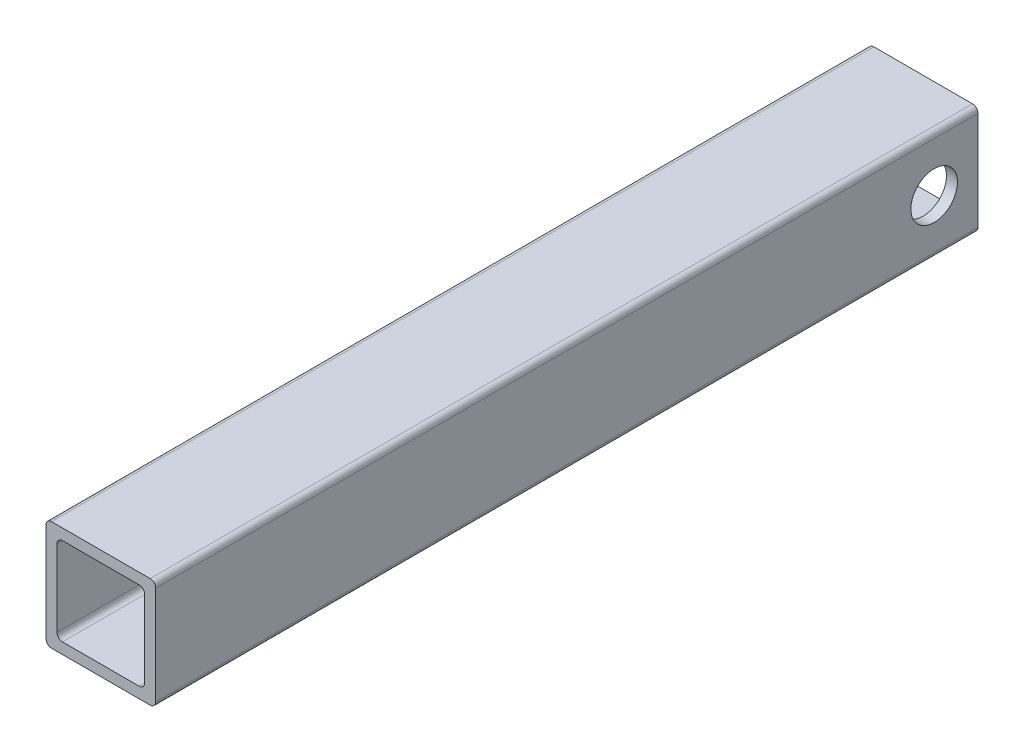
ISO-10303-21;
HEADER;
FILE_DESCRIPTION(('STEP AP214'),'2;1');
FILE_NAME('part.step','',(''),(''),'','','');
FILE_SCHEMA(('AUTOMOTIVE_DESIGN { 1 0 10303 214 1 1 1 1 }'));
ENDSEC;
DATA;
#1=APPLICATION_CONTEXT('core data for automotive mechanical design processes');
#2=APPLICATION_PROTOCOL_DEFINITION('international standard','automotive_design',2000,#1);
#3=PRODUCT_CONTEXT('',#1,'mechanical');
#4=PRODUCT('Part','Part','',(#3));
#5=PRODUCT_RELATED_PRODUCT_CATEGORY('part','',(#4));
#6=PRODUCT_DEFINITION_FORMATION('','',#4);
#7=PRODUCT_DEFINITION_CONTEXT('part definition',#1,'design');
#8=PRODUCT_DEFINITION('design','',#6,#7);
#9=PRODUCT_DEFINITION_SHAPE('','',#8);
#10=(LENGTH_UNIT() NAMED_UNIT(*) SI_UNIT(.MILLI.,.METRE.));
#11=(NAMED_UNIT(*) PLANE_ANGLE_UNIT() SI_UNIT($,.RADIAN.));
#12=(NAMED_UNIT(*) SI_UNIT($,.STERADIAN.) SOLID_ANGLE_UNIT());
#13=UNCERTAINTY_MEASURE_WITH_UNIT(LENGTH_MEASURE(1.E-05),#10,'distance_accuracy_value','');
#14=(GEOMETRIC_REPRESENTATION_CONTEXT(3) GLOBAL_UNCERTAINTY_ASSIGNED_CONTEXT((#13)) GLOBAL_UNIT_ASSIGNED_CONTEXT((#10,
#11,#12)) REPRESENTATION_CONTEXT('',''));
#15=CARTESIAN_POINT('',(0.,0.,0.));
#16=DIRECTION('',(0.,0.,1.));
#17=DIRECTION('',(1.,0.,0.));
#18=AXIS2_PLACEMENT_3D('',#15,#16,#17);
#19=CARTESIAN_POINT('',(-8.99999999999999,-9.00000000000001,150.));
#20=DIRECTION('',(0.,0.,1.));
#21=DIRECTION('',(1.,0.,0.));
#22=AXIS2_PLACEMENT_3D('',#19,#20,#21);
#23=PLANE('',#22);
#24=CARTESIAN_POINT('',(-8.99999999999999,-9.00000000000001,150.));
#25=DIRECTION('',(0.,0.,1.));
#26=DIRECTION('',(1.,0.,0.));
#27=AXIS2_PLACEMENT_3D('',#24,#25,#26);
#28=CIRCLE('',#27,1.);
#29=CARTESIAN_POINT('',(-9.99999999999999,-9.,150.));
#30=VERTEX_POINT('',#29);
#31=CARTESIAN_POINT('',(-8.99999999999999,-10.,150.));
#32=VERTEX_POINT('',#31);
#33=EDGE_CURVE('E224',#30,#32,#28,.T.);
#34=ORIENTED_EDGE('',*,*,#33,.T.);
#35=DIRECTION('',(1.,0.,0.));
#36=VECTOR('',#35,1.);
#37=CARTESIAN_POINT('',(-8.99999999999999,-10.,150.));
#38=LINE('',#37,#36);
#39=CARTESIAN_POINT('',(9.,-10.,150.));
#40=VERTEX_POINT('',#39);
#41=EDGE_CURVE('E227',#32,#40,#38,.T.);
#42=ORIENTED_EDGE('',*,*,#41,.T.);
#43=CARTESIAN_POINT('',(9.00000000000001,-9.00000000000001,150.));
#44=DIRECTION('',(0.,0.,1.));
#45=DIRECTION('',(1.,0.,0.));
#46=AXIS2_PLACEMENT_3D('',#43,#44,#45);
#47=CIRCLE('',#46,0.999999999999999);
#48=CARTESIAN_POINT('',(10.,-9.,150.));
#49=VERTEX_POINT('',#48);
#50=EDGE_CURVE('E230',#40,#49,#47,.T.);
#51=ORIENTED_EDGE('',*,*,#50,.T.);
#52=DIRECTION('',(0.,1.,0.));
#53=VECTOR('',#52,1.);
#54=CARTESIAN_POINT('',(10.,8.99999999999999,150.));
#55=LINE('',#54,#53);
#56=CARTESIAN_POINT('',(10.,8.99999999999999,150.));
#57=VERTEX_POINT('',#56);
#58=EDGE_CURVE('E232',#49,#57,#55,.T.);
#59=ORIENTED_EDGE('',*,*,#58,.T.);
#60=CARTESIAN_POINT('',(9.00000000000001,9.,150.));
#61=DIRECTION('',(0.,0.,1.));
#62=DIRECTION('',(-1.,0.,0.));
#63=AXIS2_PLACEMENT_3D('',#60,#61,#62);
#64=CIRCLE('',#63,1.);
#65=CARTESIAN_POINT('',(9.00000000000001,10.,150.));
#66=VERTEX_POINT('',#65);
#67=EDGE_CURVE('E234',#57,#66,#64,.T.);
#68=ORIENTED_EDGE('',*,*,#67,.T.);
#69=DIRECTION('',(-1.,0.,0.));
#70=VECTOR('',#69,1.);
#71=CARTESIAN_POINT('',(-8.99999999999998,10.,150.));
#72=LINE('',#71,#70);
#73=CARTESIAN_POINT('',(-8.99999999999998,10.,150.));
#74=VERTEX_POINT('',#73);
#75=EDGE_CURVE('E236',#66,#74,#72,.T.);
#76=ORIENTED_EDGE('',*,*,#75,.T.);
#77=CARTESIAN_POINT('',(-8.99999999999999,9.,150.));
#78=DIRECTION('',(0.,0.,1.));
#79=DIRECTION('',(1.,0.,0.));
#80=AXIS2_PLACEMENT_3D('',#77,#78,#79);
#81=CIRCLE('',#80,0.999999999999999);
#82=CARTESIAN_POINT('',(-9.99999999999999,8.99999999999999,150.));
#83=VERTEX_POINT('',#82);
#84=EDGE_CURVE('E238',#74,#83,#81,.T.);
#85=ORIENTED_EDGE('',*,*,#84,.T.);
#86=DIRECTION('',(0.,-1.,0.));
#87=VECTOR('',#86,1.);
#88=CARTESIAN_POINT('',(-9.99999999999999,8.99999999999999,150.));
#89=LINE('',#88,#87);
#90=EDGE_CURVE('E240',#83,#30,#89,.T.);
#91=ORIENTED_EDGE('',*,*,#90,.T.);
#92=EDGE_LOOP('',(#34,#42,#51,#59,#68,#76,#85,#91));
#93=FACE_BOUND('',#92,.T.);
#94=DIRECTION('',(0.,1.,0.));
#95=VECTOR('',#94,1.);
#96=CARTESIAN_POINT('',(7.99999999999999,6.99999999999999,150.));
#97=LINE('',#96,#95);
#98=CARTESIAN_POINT('',(8.,-6.99999999999999,150.));
#99=VERTEX_POINT('',#98);
#100=CARTESIAN_POINT('',(7.99999999999999,6.99999999999999,150.));
#101=VERTEX_POINT('',#100);
#102=EDGE_CURVE('E165',#99,#101,#97,.T.);
#103=ORIENTED_EDGE('',*,*,#102,.F.);
#104=CARTESIAN_POINT('',(7.,-7.,150.));
#105=DIRECTION('',(0.,0.,1.));
#106=DIRECTION('',(1.,0.,0.));
#107=AXIS2_PLACEMENT_3D('',#104,#105,#106);
#108=CIRCLE('',#107,1.);
#109=CARTESIAN_POINT('',(6.99999999999999,-8.,150.));
#110=VERTEX_POINT('',#109);
#111=EDGE_CURVE('E157',#110,#99,#108,.T.);
#112=ORIENTED_EDGE('',*,*,#111,.F.);
#113=DIRECTION('',(1.,0.,0.));
#114=VECTOR('',#113,1.);
#115=CARTESIAN_POINT('',(-6.99999999999999,-8.,150.));
#116=LINE('',#115,#114);
#117=CARTESIAN_POINT('',(-6.99999999999999,-8.,150.));
#118=VERTEX_POINT('',#117);
#119=EDGE_CURVE('E191',#118,#110,#116,.T.);
#120=ORIENTED_EDGE('',*,*,#119,.F.);
#121=CARTESIAN_POINT('',(-7.,-7.,150.));
#122=DIRECTION('',(0.,0.,1.));
#123=DIRECTION('',(1.,0.,0.));
#124=AXIS2_PLACEMENT_3D('',#121,#122,#123);
#125=CIRCLE('',#124,1.);
#126=CARTESIAN_POINT('',(-8.,-6.99999999999999,150.));
#127=VERTEX_POINT('',#126);
#128=EDGE_CURVE('E189',#127,#118,#125,.T.);
#129=ORIENTED_EDGE('',*,*,#128,.F.);
#130=DIRECTION('',(0.,-1.,0.));
#131=VECTOR('',#130,1.);
#132=CARTESIAN_POINT('',(-8.,6.99999999999999,150.));
#133=LINE('',#132,#131);
#134=CARTESIAN_POINT('',(-8.,6.99999999999999,150.));
#135=VERTEX_POINT('',#134);
#136=EDGE_CURVE('E187',#135,#127,#133,.T.);
#137=ORIENTED_EDGE('',*,*,#136,.F.);
#138=CARTESIAN_POINT('',(-7.,6.99999999999999,150.));
#139=DIRECTION('',(0.,0.,1.));
#140=DIRECTION('',(1.,0.,0.));
#141=AXIS2_PLACEMENT_3D('',#138,#139,#140);
#142=CIRCLE('',#141,1.);
#143=CARTESIAN_POINT('',(-6.99999999999999,7.99999999999999,150.));
#144=VERTEX_POINT('',#143);
#145=EDGE_CURVE('E185',#144,#135,#142,.T.);
#146=ORIENTED_EDGE('',*,*,#145,.F.);
#147=DIRECTION('',(-1.,0.,0.));
#148=VECTOR('',#147,1.);
#149=CARTESIAN_POINT('',(-6.99999999999999,7.99999999999999,150.));
#150=LINE('',#149,#148);
#151=CARTESIAN_POINT('',(6.99999999999999,8.,150.));
#152=VERTEX_POINT('',#151);
#153=EDGE_CURVE('E180',#152,#144,#150,.T.);
#154=ORIENTED_EDGE('',*,*,#153,.F.);
#155=CARTESIAN_POINT('',(6.99999999999999,7.,150.));
#156=DIRECTION('',(0.,0.,1.));
#157=DIRECTION('',(-1.,0.,0.));
#158=AXIS2_PLACEMENT_3D('',#155,#156,#157);
#159=CIRCLE('',#158,1.);
#160=EDGE_CURVE('E178',#101,#152,#159,.T.);
#161=ORIENTED_EDGE('',*,*,#160,.F.);
#162=EDGE_LOOP('',(#103,#112,#120,#129,#137,#146,#154,#161));
#163=FACE_BOUND('',#162,.T.);
#164=ADVANCED_FACE('F43',(#93,#163),#23,.T.);
#165=CARTESIAN_POINT('',(-8.99999999999999,-9.00000000000001,0.));
#166=DIRECTION('',(0.,0.,1.));
#167=DIRECTION('',(1.,0.,0.));
#168=AXIS2_PLACEMENT_3D('',#165,#166,#167);
#169=PLANE('',#168);
#170=CARTESIAN_POINT('',(-8.99999999999999,-9.00000000000001,0.));
#171=DIRECTION('',(0.,0.,1.));
#172=DIRECTION('',(1.,0.,0.));
#173=AXIS2_PLACEMENT_3D('',#170,#171,#172);
#174=CIRCLE('',#173,1.);
#175=CARTESIAN_POINT('',(-9.99999999999999,-9.,0.));
#176=VERTEX_POINT('',#175);
#177=CARTESIAN_POINT('',(-8.99999999999999,-10.,0.));
#178=VERTEX_POINT('',#177);
#179=EDGE_CURVE('E173',#176,#178,#174,.T.);
#180=ORIENTED_EDGE('',*,*,#179,.F.);
#181=DIRECTION('',(0.,-1.,0.));
#182=VECTOR('',#181,1.);
#183=CARTESIAN_POINT('',(-9.99999999999999,8.99999999999999,0.));
#184=LINE('',#183,#182);
#185=CARTESIAN_POINT('',(-9.99999999999999,8.99999999999999,0.));
#186=VERTEX_POINT('',#185);
#187=EDGE_CURVE('E228',#186,#176,#184,.T.);
#188=ORIENTED_EDGE('',*,*,#187,.F.);
#189=CARTESIAN_POINT('',(-8.99999999999999,9.,0.));
#190=DIRECTION('',(0.,0.,1.));
#191=DIRECTION('',(1.,0.,0.));
#192=AXIS2_PLACEMENT_3D('',#189,#190,#191);
#193=CIRCLE('',#192,0.999999999999999);
#194=CARTESIAN_POINT('',(-8.99999999999998,10.,0.));
#195=VERTEX_POINT('',#194);
#196=EDGE_CURVE('E255',#195,#186,#193,.T.);
#197=ORIENTED_EDGE('',*,*,#196,.F.);
#198=DIRECTION('',(-1.,0.,0.));
#199=VECTOR('',#198,1.);
#200=CARTESIAN_POINT('',(-8.99999999999998,10.,0.));
#201=LINE('',#200,#199);
#202=CARTESIAN_POINT('',(9.00000000000001,10.,0.));
#203=VERTEX_POINT('',#202);
#204=EDGE_CURVE('E253',#203,#195,#201,.T.);
#205=ORIENTED_EDGE('',*,*,#204,.F.);
#206=CARTESIAN_POINT('',(9.00000000000001,9.,0.));
#207=DIRECTION('',(0.,0.,1.));
#208=DIRECTION('',(-1.,0.,0.));
#209=AXIS2_PLACEMENT_3D('',#206,#207,#208);
#210=CIRCLE('',#209,1.);
#211=CARTESIAN_POINT('',(10.,8.99999999999999,0.));
#212=VERTEX_POINT('',#211);
#213=EDGE_CURVE('E251',#212,#203,#210,.T.);
#214=ORIENTED_EDGE('',*,*,#213,.F.);
#215=DIRECTION('',(0.,1.,0.));
#216=VECTOR('',#215,1.);
#217=CARTESIAN_POINT('',(10.,8.99999999999999,0.));
#218=LINE('',#217,#216);
#219=CARTESIAN_POINT('',(10.,-9.,0.));
#220=VERTEX_POINT('',#219);
#221=EDGE_CURVE('E249',#220,#212,#218,.T.);
#222=ORIENTED_EDGE('',*,*,#221,.F.);
#223=CARTESIAN_POINT('',(9.00000000000001,-9.00000000000001,0.));
#224=DIRECTION('',(0.,0.,1.));
#225=DIRECTION('',(1.,0.,0.));
#226=AXIS2_PLACEMENT_3D('',#223,#224,#225);
#227=CIRCLE('',#226,0.999999999999999);
#228=CARTESIAN_POINT('',(9.,-10.,0.));
#229=VERTEX_POINT('',#228);
#230=EDGE_CURVE('E247',#229,#220,#227,.T.);
#231=ORIENTED_EDGE('',*,*,#230,.F.);
#232=DIRECTION('',(1.,0.,0.));
#233=VECTOR('',#232,1.);
#234=CARTESIAN_POINT('',(-8.99999999999999,-10.,0.));
#235=LINE('',#234,#233);
#236=EDGE_CURVE('E245',#178,#229,#235,.T.);
#237=ORIENTED_EDGE('',*,*,#236,.F.);
#238=EDGE_LOOP('',(#180,#188,#197,#205,#214,#222,#231,#237));
#239=FACE_BOUND('',#238,.T.);
#240=CARTESIAN_POINT('',(7.,-7.,0.));
#241=DIRECTION('',(0.,0.,1.));
#242=DIRECTION('',(1.,0.,0.));
#243=AXIS2_PLACEMENT_3D('',#240,#241,#242);
#244=CIRCLE('',#243,1.);
#245=CARTESIAN_POINT('',(6.99999999999999,-8.,0.));
#246=VERTEX_POINT('',#245);
#247=CARTESIAN_POINT('',(8.,-6.99999999999999,0.));
#248=VERTEX_POINT('',#247);
#249=EDGE_CURVE('E67',#246,#248,#244,.T.);
#250=ORIENTED_EDGE('',*,*,#249,.T.);
#251=DIRECTION('',(0.,1.,0.));
#252=VECTOR('',#251,1.);
#253=CARTESIAN_POINT('',(7.99999999999999,6.99999999999999,0.));
#254=LINE('',#253,#252);
#255=CARTESIAN_POINT('',(7.99999999999999,6.99999999999999,0.));
#256=VERTEX_POINT('',#255);
#257=EDGE_CURVE('E172',#248,#256,#254,.T.);
#258=ORIENTED_EDGE('',*,*,#257,.T.);
#259=CARTESIAN_POINT('',(6.99999999999999,7.,0.));
#260=DIRECTION('',(0.,0.,1.));
#261=DIRECTION('',(-1.,0.,0.));
#262=AXIS2_PLACEMENT_3D('',#259,#260,#261);
#263=CIRCLE('',#262,1.);
#264=CARTESIAN_POINT('',(6.99999999999999,8.,0.));
#265=VERTEX_POINT('',#264);
#266=EDGE_CURVE('E196',#256,#265,#263,.T.);
#267=ORIENTED_EDGE('',*,*,#266,.T.);
#268=DIRECTION('',(-1.,0.,0.));
#269=VECTOR('',#268,1.);
#270=CARTESIAN_POINT('',(-6.99999999999999,7.99999999999999,0.));
#271=LINE('',#270,#269);
#272=CARTESIAN_POINT('',(-6.99999999999999,7.99999999999999,0.));
#273=VERTEX_POINT('',#272);
#274=EDGE_CURVE('E199',#265,#273,#271,.T.);
#275=ORIENTED_EDGE('',*,*,#274,.T.);
#276=CARTESIAN_POINT('',(-7.,6.99999999999999,0.));
#277=DIRECTION('',(0.,0.,1.));
#278=DIRECTION('',(1.,0.,0.));
#279=AXIS2_PLACEMENT_3D('',#276,#277,#278);
#280=CIRCLE('',#279,1.);
#281=CARTESIAN_POINT('',(-8.,6.99999999999999,0.));
#282=VERTEX_POINT('',#281);
#283=EDGE_CURVE('E202',#273,#282,#280,.T.);
#284=ORIENTED_EDGE('',*,*,#283,.T.);
#285=DIRECTION('',(0.,-1.,0.));
#286=VECTOR('',#285,1.);
#287=CARTESIAN_POINT('',(-8.,6.99999999999999,0.));
#288=LINE('',#287,#286);
#289=CARTESIAN_POINT('',(-8.,-6.99999999999999,0.));
#290=VERTEX_POINT('',#289);
#291=EDGE_CURVE('E205',#282,#290,#288,.T.);
#292=ORIENTED_EDGE('',*,*,#291,.T.);
#293=CARTESIAN_POINT('',(-7.,-7.,0.));
#294=DIRECTION('',(0.,0.,1.));
#295=DIRECTION('',(1.,0.,0.));
#296=AXIS2_PLACEMENT_3D('',#293,#294,#295);
#297=CIRCLE('',#296,1.);
#298=CARTESIAN_POINT('',(-6.99999999999999,-8.,0.));
#299=VERTEX_POINT('',#298);
#300=EDGE_CURVE('E208',#290,#299,#297,.T.);
#301=ORIENTED_EDGE('',*,*,#300,.T.);
#302=DIRECTION('',(1.,0.,0.));
#303=VECTOR('',#302,1.);
#304=CARTESIAN_POINT('',(-6.99999999999999,-8.,0.));
#305=LINE('',#304,#303);
#306=EDGE_CURVE('E166',#299,#246,#305,.T.);
#307=ORIENTED_EDGE('',*,*,#306,.T.);
#308=EDGE_LOOP('',(#250,#258,#267,#275,#284,#292,#301,#307));
#309=FACE_BOUND('',#308,.T.);
#310=ADVANCED_FACE('F286',(#239,#309),#169,.F.);
#311=CARTESIAN_POINT('',(-8.99999999999999,-9.00000000000001,150.));
#312=DIRECTION('',(0.,0.,-1.));
#313=DIRECTION('',(-1.,0.,0.));
#314=AXIS2_PLACEMENT_3D('',#311,#312,#313);
#315=CYLINDRICAL_SURFACE('',#314,1.);
#316=ORIENTED_EDGE('',*,*,#179,.T.);
#317=DIRECTION('',(0.,0.,-1.));
#318=VECTOR('',#317,1.);
#319=CARTESIAN_POINT('',(-8.99999999999999,-10.,150.));
#320=LINE('',#319,#318);
#321=EDGE_CURVE('E11',#32,#178,#320,.T.);
#322=ORIENTED_EDGE('',*,*,#321,.F.);
#323=ORIENTED_EDGE('',*,*,#33,.F.);
#324=DIRECTION('',(0.,0.,-1.));
#325=VECTOR('',#324,1.);
#326=CARTESIAN_POINT('',(-9.99999999999999,-9.,150.));
#327=LINE('',#326,#325);
#328=EDGE_CURVE('E242',#30,#176,#327,.T.);
#329=ORIENTED_EDGE('',*,*,#328,.T.);
#330=EDGE_LOOP('',(#316,#322,#323,#329));
#331=FACE_BOUND('',#330,.T.);
#332=ADVANCED_FACE('F45',(#331),#315,.T.);
#333=CARTESIAN_POINT('',(-8.99999999999999,-10.,150.));
#334=DIRECTION('',(0.,1.,0.));
#335=DIRECTION('',(0.,0.,1.));
#336=AXIS2_PLACEMENT_3D('',#333,#334,#335);
#337=PLANE('',#336);
#338=ORIENTED_EDGE('',*,*,#236,.T.);
#339=DIRECTION('',(0.,0.,-1.));
#340=VECTOR('',#339,1.);
#341=CARTESIAN_POINT('',(9.,-10.,150.));
#342=LINE('',#341,#340);
#343=EDGE_CURVE('E52',#40,#229,#342,.T.);
#344=ORIENTED_EDGE('',*,*,#343,.F.);
#345=ORIENTED_EDGE('',*,*,#41,.F.);
#346=ORIENTED_EDGE('',*,*,#321,.T.);
#347=EDGE_LOOP('',(#338,#344,#345,#346));
#348=FACE_BOUND('',#347,.T.);
#349=ADVANCED_FACE('F303',(#348),#337,.F.);
#350=CARTESIAN_POINT('',(9.00000000000001,-9.00000000000001,150.));
#351=DIRECTION('',(0.,0.,-1.));
#352=DIRECTION('',(-1.,0.,0.));
#353=AXIS2_PLACEMENT_3D('',#350,#351,#352);
#354=CYLINDRICAL_SURFACE('',#353,0.999999999999999);
#355=ORIENTED_EDGE('',*,*,#230,.T.);
#356=DIRECTION('',(0.,0.,-1.));
#357=VECTOR('',#356,1.);
#358=CARTESIAN_POINT('',(10.,-9.,150.));
#359=LINE('',#358,#357);
#360=EDGE_CURVE('E272',#49,#220,#359,.T.);
#361=ORIENTED_EDGE('',*,*,#360,.F.);
#362=ORIENTED_EDGE('',*,*,#50,.F.);
#363=ORIENTED_EDGE('',*,*,#343,.T.);
#364=EDGE_LOOP('',(#355,#361,#362,#363));
#365=FACE_BOUND('',#364,.T.);
#366=ADVANCED_FACE('F280',(#365),#354,.T.);
#367=CARTESIAN_POINT('',(10.,8.99999999999999,150.));
#368=DIRECTION('',(-1.,0.,0.));
#369=DIRECTION('',(0.,-1.,0.));
#370=AXIS2_PLACEMENT_3D('',#367,#368,#369);
#371=PLANE('',#370);
#372=CARTESIAN_POINT('',(10.,0.,8.));
#373=DIRECTION('',(1.,0.,0.));
#374=DIRECTION('',(0.,1.,0.));
#375=AXIS2_PLACEMENT_3D('',#372,#373,#374);
#376=CIRCLE('',#375,4.25);
#377=CARTESIAN_POINT('',(10.,4.25,8.));
#378=VERTEX_POINT('',#377);
#379=EDGE_CURVE('E345',#378,#378,#376,.T.);
#380=ORIENTED_EDGE('',*,*,#379,.F.);
#381=EDGE_LOOP('',(#380));
#382=FACE_BOUND('',#381,.T.);
#383=ORIENTED_EDGE('',*,*,#221,.T.);
#384=DIRECTION('',(0.,0.,-1.));
#385=VECTOR('',#384,1.);
#386=CARTESIAN_POINT('',(10.,8.99999999999999,150.));
#387=LINE('',#386,#385);
#388=EDGE_CURVE('E269',#57,#212,#387,.T.);
#389=ORIENTED_EDGE('',*,*,#388,.F.);
#390=ORIENTED_EDGE('',*,*,#58,.F.);
#391=ORIENTED_EDGE('',*,*,#360,.T.);
#392=EDGE_LOOP('',(#383,#389,#390,#391));
#393=FACE_BOUND('',#392,.T.);
#394=ADVANCED_FACE('F292',(#382,#393),#371,.F.);
#395=CARTESIAN_POINT('',(9.00000000000001,9.,150.));
#396=DIRECTION('',(0.,0.,-1.));
#397=DIRECTION('',(-1.,0.,0.));
#398=AXIS2_PLACEMENT_3D('',#395,#396,#397);
#399=CYLINDRICAL_SURFACE('',#398,1.);
#400=ORIENTED_EDGE('',*,*,#213,.T.);
#401=DIRECTION('',(0.,0.,-1.));
#402=VECTOR('',#401,1.);
#403=CARTESIAN_POINT('',(9.00000000000001,10.,150.));
#404=LINE('',#403,#402);
#405=EDGE_CURVE('E266',#66,#203,#404,.T.);
#406=ORIENTED_EDGE('',*,*,#405,.F.);
#407=ORIENTED_EDGE('',*,*,#67,.F.);
#408=ORIENTED_EDGE('',*,*,#388,.T.);
#409=EDGE_LOOP('',(#400,#406,#407,#408));
#410=FACE_BOUND('',#409,.T.);
#411=ADVANCED_FACE('F296',(#410),#399,.T.);
#412=CARTESIAN_POINT('',(-8.99999999999998,10.,150.));
#413=DIRECTION('',(0.,-1.,0.));
#414=DIRECTION('',(0.,0.,-1.));
#415=AXIS2_PLACEMENT_3D('',#412,#413,#414);
#416=PLANE('',#415);
#417=ORIENTED_EDGE('',*,*,#204,.T.);
#418=DIRECTION('',(0.,0.,-1.));
#419=VECTOR('',#418,1.);
#420=CARTESIAN_POINT('',(-8.99999999999998,10.,150.));
#421=LINE('',#420,#419);
#422=EDGE_CURVE('E263',#74,#195,#421,.T.);
#423=ORIENTED_EDGE('',*,*,#422,.F.);
#424=ORIENTED_EDGE('',*,*,#75,.F.);
#425=ORIENTED_EDGE('',*,*,#405,.T.);
#426=EDGE_LOOP('',(#417,#423,#424,#425));
#427=FACE_BOUND('',#426,.T.);
#428=ADVANCED_FACE('F316',(#427),#416,.F.);
#429=CARTESIAN_POINT('',(-8.99999999999999,9.,150.));
#430=DIRECTION('',(0.,0.,-1.));
#431=DIRECTION('',(-1.,0.,0.));
#432=AXIS2_PLACEMENT_3D('',#429,#430,#431);
#433=CYLINDRICAL_SURFACE('',#432,0.999999999999999);
#434=ORIENTED_EDGE('',*,*,#196,.T.);
#435=DIRECTION('',(0.,0.,-1.));
#436=VECTOR('',#435,1.);
#437=CARTESIAN_POINT('',(-9.99999999999999,8.99999999999999,150.));
#438=LINE('',#437,#436);
#439=EDGE_CURVE('E260',#83,#186,#438,.T.);
#440=ORIENTED_EDGE('',*,*,#439,.F.);
#441=ORIENTED_EDGE('',*,*,#84,.F.);
#442=ORIENTED_EDGE('',*,*,#422,.T.);
#443=EDGE_LOOP('',(#434,#440,#441,#442));
#444=FACE_BOUND('',#443,.T.);
#445=ADVANCED_FACE('F314',(#444),#433,.T.);
#446=CARTESIAN_POINT('',(-9.99999999999999,8.99999999999999,150.));
#447=DIRECTION('',(1.,0.,0.));
#448=DIRECTION('',(0.,1.,0.));
#449=AXIS2_PLACEMENT_3D('',#446,#447,#448);
#450=PLANE('',#449);
#451=CARTESIAN_POINT('',(-10.,0.,8.));
#452=DIRECTION('',(1.,0.,0.));
#453=DIRECTION('',(0.,1.,0.));
#454=AXIS2_PLACEMENT_3D('',#451,#452,#453);
#455=CIRCLE('',#454,4.25);
#456=CARTESIAN_POINT('',(-10.,4.25,8.));
#457=VERTEX_POINT('',#456);
#458=EDGE_CURVE('E343',#457,#457,#455,.T.);
#459=ORIENTED_EDGE('',*,*,#458,.T.);
#460=EDGE_LOOP('',(#459));
#461=FACE_BOUND('',#460,.T.);
#462=ORIENTED_EDGE('',*,*,#187,.T.);
#463=ORIENTED_EDGE('',*,*,#328,.F.);
#464=ORIENTED_EDGE('',*,*,#90,.F.);
#465=ORIENTED_EDGE('',*,*,#439,.T.);
#466=EDGE_LOOP('',(#462,#463,#464,#465));
#467=FACE_BOUND('',#466,.T.);
#468=ADVANCED_FACE('F309',(#461,#467),#450,.F.);
#469=CARTESIAN_POINT('',(7.,-7.,150.));
#470=DIRECTION('',(0.,0.,-1.));
#471=DIRECTION('',(-1.,0.,0.));
#472=AXIS2_PLACEMENT_3D('',#469,#470,#471);
#473=CYLINDRICAL_SURFACE('',#472,1.);
#474=ORIENTED_EDGE('',*,*,#249,.F.);
#475=DIRECTION('',(0.,0.,-1.));
#476=VECTOR('',#475,1.);
#477=CARTESIAN_POINT('',(6.99999999999999,-8.,150.));
#478=LINE('',#477,#476);
#479=EDGE_CURVE('E161',#110,#246,#478,.T.);
#480=ORIENTED_EDGE('',*,*,#479,.F.);
#481=ORIENTED_EDGE('',*,*,#111,.T.);
#482=DIRECTION('',(0.,0.,-1.));
#483=VECTOR('',#482,1.);
#484=CARTESIAN_POINT('',(8.,-6.99999999999999,150.));
#485=LINE('',#484,#483);
#486=EDGE_CURVE('E160',#99,#248,#485,.T.);
#487=ORIENTED_EDGE('',*,*,#486,.T.);
#488=EDGE_LOOP('',(#474,#480,#481,#487));
#489=FACE_BOUND('',#488,.T.);
#490=ADVANCED_FACE('F159',(#489),#473,.F.);
#491=CARTESIAN_POINT('',(7.99999999999999,6.99999999999999,150.));
#492=DIRECTION('',(-1.,0.,0.));
#493=DIRECTION('',(0.,-1.,0.));
#494=AXIS2_PLACEMENT_3D('',#491,#492,#493);
#495=PLANE('',#494);
#496=CARTESIAN_POINT('',(7.99999999999999,0.,8.));
#497=DIRECTION('',(-1.,0.,0.));
#498=DIRECTION('',(0.,-1.,0.));
#499=AXIS2_PLACEMENT_3D('',#496,#497,#498);
#500=CIRCLE('',#499,4.25);
#501=CARTESIAN_POINT('',(7.99999999999999,-4.25,8.));
#502=VERTEX_POINT('',#501);
#503=EDGE_CURVE('E194',#502,#502,#500,.T.);
#504=ORIENTED_EDGE('',*,*,#503,.F.);
#505=EDGE_LOOP('',(#504));
#506=FACE_BOUND('',#505,.T.);
#507=ORIENTED_EDGE('',*,*,#257,.F.);
#508=ORIENTED_EDGE('',*,*,#486,.F.);
#509=ORIENTED_EDGE('',*,*,#102,.T.);
#510=DIRECTION('',(0.,0.,-1.));
#511=VECTOR('',#510,1.);
#512=CARTESIAN_POINT('',(7.99999999999999,6.99999999999999,150.));
#513=LINE('',#512,#511);
#514=EDGE_CURVE('E174',#101,#256,#513,.T.);
#515=ORIENTED_EDGE('',*,*,#514,.T.);
#516=EDGE_LOOP('',(#507,#508,#509,#515));
#517=FACE_BOUND('',#516,.T.);
#518=ADVANCED_FACE('F169',(#506,#517),#495,.T.);
#519=CARTESIAN_POINT('',(6.99999999999999,7.,150.));
#520=DIRECTION('',(0.,0.,-1.));
#521=DIRECTION('',(-1.,0.,0.));
#522=AXIS2_PLACEMENT_3D('',#519,#520,#521);
#523=CYLINDRICAL_SURFACE('',#522,1.);
#524=ORIENTED_EDGE('',*,*,#266,.F.);
#525=ORIENTED_EDGE('',*,*,#514,.F.);
#526=ORIENTED_EDGE('',*,*,#160,.T.);
#527=DIRECTION('',(0.,0.,-1.));
#528=VECTOR('',#527,1.);
#529=CARTESIAN_POINT('',(6.99999999999999,8.,150.));
#530=LINE('',#529,#528);
#531=EDGE_CURVE('E221',#152,#265,#530,.T.);
#532=ORIENTED_EDGE('',*,*,#531,.T.);
#533=EDGE_LOOP('',(#524,#525,#526,#532));
#534=FACE_BOUND('',#533,.T.);
#535=ADVANCED_FACE('F356',(#534),#523,.F.);
#536=CARTESIAN_POINT('',(-6.99999999999999,7.99999999999999,150.));
#537=DIRECTION('',(0.,-1.,0.));
#538=DIRECTION('',(1.,0.,0.));
#539=AXIS2_PLACEMENT_3D('',#536,#537,#538);
#540=PLANE('',#539);
#541=ORIENTED_EDGE('',*,*,#274,.F.);
#542=ORIENTED_EDGE('',*,*,#531,.F.);
#543=ORIENTED_EDGE('',*,*,#153,.T.);
#544=DIRECTION('',(0.,0.,-1.));
#545=VECTOR('',#544,1.);
#546=CARTESIAN_POINT('',(-6.99999999999999,7.99999999999999,150.));
#547=LINE('',#546,#545);
#548=EDGE_CURVE('E219',#144,#273,#547,.T.);
#549=ORIENTED_EDGE('',*,*,#548,.T.);
#550=EDGE_LOOP('',(#541,#542,#543,#549));
#551=FACE_BOUND('',#550,.T.);
#552=ADVANCED_FACE('F361',(#551),#540,.T.);
#553=CARTESIAN_POINT('',(-7.,6.99999999999999,150.));
#554=DIRECTION('',(0.,0.,-1.));
#555=DIRECTION('',(-1.,0.,0.));
#556=AXIS2_PLACEMENT_3D('',#553,#554,#555);
#557=CYLINDRICAL_SURFACE('',#556,1.);
#558=ORIENTED_EDGE('',*,*,#283,.F.);
#559=ORIENTED_EDGE('',*,*,#548,.F.);
#560=ORIENTED_EDGE('',*,*,#145,.T.);
#561=DIRECTION('',(0.,0.,-1.));
#562=VECTOR('',#561,1.);
#563=CARTESIAN_POINT('',(-8.,6.99999999999999,150.));
#564=LINE('',#563,#562);
#565=EDGE_CURVE('E217',#135,#282,#564,.T.);
#566=ORIENTED_EDGE('',*,*,#565,.T.);
#567=EDGE_LOOP('',(#558,#559,#560,#566));
#568=FACE_BOUND('',#567,.T.);
#569=ADVANCED_FACE('F367',(#568),#557,.F.);
#570=CARTESIAN_POINT('',(-8.,6.99999999999999,150.));
#571=DIRECTION('',(1.,0.,0.));
#572=DIRECTION('',(0.,1.,0.));
#573=AXIS2_PLACEMENT_3D('',#570,#571,#572);
#574=PLANE('',#573);
#575=CARTESIAN_POINT('',(-8.,0.,8.));
#576=DIRECTION('',(1.,0.,0.));
#577=DIRECTION('',(0.,1.,0.));
#578=AXIS2_PLACEMENT_3D('',#575,#576,#577);
#579=CIRCLE('',#578,4.25);
#580=CARTESIAN_POINT('',(-8.,4.25,8.));
#581=VERTEX_POINT('',#580);
#582=EDGE_CURVE('E47',#581,#581,#579,.T.);
#583=ORIENTED_EDGE('',*,*,#582,.F.);
#584=EDGE_LOOP('',(#583));
#585=FACE_BOUND('',#584,.T.);
#586=ORIENTED_EDGE('',*,*,#291,.F.);
#587=ORIENTED_EDGE('',*,*,#565,.F.);
#588=ORIENTED_EDGE('',*,*,#136,.T.);
#589=DIRECTION('',(0.,0.,-1.));
#590=VECTOR('',#589,1.);
#591=CARTESIAN_POINT('',(-8.,-6.99999999999999,150.));
#592=LINE('',#591,#590);
#593=EDGE_CURVE('E215',#127,#290,#592,.T.);
#594=ORIENTED_EDGE('',*,*,#593,.T.);
#595=EDGE_LOOP('',(#586,#587,#588,#594));
#596=FACE_BOUND('',#595,.T.);
#597=ADVANCED_FACE('F371',(#585,#596),#574,.T.);
#598=CARTESIAN_POINT('',(-7.,-7.,150.));
#599=DIRECTION('',(0.,0.,-1.));
#600=DIRECTION('',(-1.,0.,0.));
#601=AXIS2_PLACEMENT_3D('',#598,#599,#600);
#602=CYLINDRICAL_SURFACE('',#601,1.);
#603=ORIENTED_EDGE('',*,*,#300,.F.);
#604=ORIENTED_EDGE('',*,*,#593,.F.);
#605=ORIENTED_EDGE('',*,*,#128,.T.);
#606=DIRECTION('',(0.,0.,-1.));
#607=VECTOR('',#606,1.);
#608=CARTESIAN_POINT('',(-6.99999999999999,-8.,150.));
#609=LINE('',#608,#607);
#610=EDGE_CURVE('E59',#118,#299,#609,.T.);
#611=ORIENTED_EDGE('',*,*,#610,.T.);
#612=EDGE_LOOP('',(#603,#604,#605,#611));
#613=FACE_BOUND('',#612,.T.);
#614=ADVANCED_FACE('F374',(#613),#602,.F.);
#615=CARTESIAN_POINT('',(-6.99999999999999,-8.,150.));
#616=DIRECTION('',(0.,1.,0.));
#617=DIRECTION('',(0.,0.,1.));
#618=AXIS2_PLACEMENT_3D('',#615,#616,#617);
#619=PLANE('',#618);
#620=ORIENTED_EDGE('',*,*,#306,.F.);
#621=ORIENTED_EDGE('',*,*,#610,.F.);
#622=ORIENTED_EDGE('',*,*,#119,.T.);
#623=ORIENTED_EDGE('',*,*,#479,.T.);
#624=EDGE_LOOP('',(#620,#621,#622,#623));
#625=FACE_BOUND('',#624,.T.);
#626=ADVANCED_FACE('F378',(#625),#619,.T.);
#627=CARTESIAN_POINT('',(-10.,0.,8.));
#628=DIRECTION('',(1.,0.,0.));
#629=DIRECTION('',(0.,1.,0.));
#630=AXIS2_PLACEMENT_3D('',#627,#628,#629);
#631=CYLINDRICAL_SURFACE('',#630,4.25);
#632=ORIENTED_EDGE('',*,*,#582,.T.);
#633=EDGE_LOOP('',(#632));
#634=FACE_BOUND('',#633,.T.);
#635=ORIENTED_EDGE('',*,*,#458,.F.);
#636=EDGE_LOOP('',(#635));
#637=FACE_BOUND('',#636,.T.);
#638=ADVANCED_FACE('F382',(#634,#637),#631,.F.);
#639=ORIENTED_EDGE('',*,*,#503,.T.);
#640=EDGE_LOOP('',(#639));
#641=FACE_BOUND('',#640,.T.);
#642=ORIENTED_EDGE('',*,*,#379,.T.);
#643=EDGE_LOOP('',(#642));
#644=FACE_BOUND('',#643,.T.);
#645=ADVANCED_FACE('F353',(#641,#644),#631,.F.);
#646=CLOSED_SHELL('',(#164,#310,#332,#349,#366,#394,#411,#428,#445,#468,#490,#518,#535,#552,
#569,#597,#614,#626,#638,#645));
#647=MANIFOLD_SOLID_BREP('B2',#646);
#648=ADVANCED_BREP_SHAPE_REPRESENTATION('',(#18,#647),#14);
#649=SHAPE_DEFINITION_REPRESENTATION(#9,#648);
ENDSEC;
END-ISO-10303-21;
